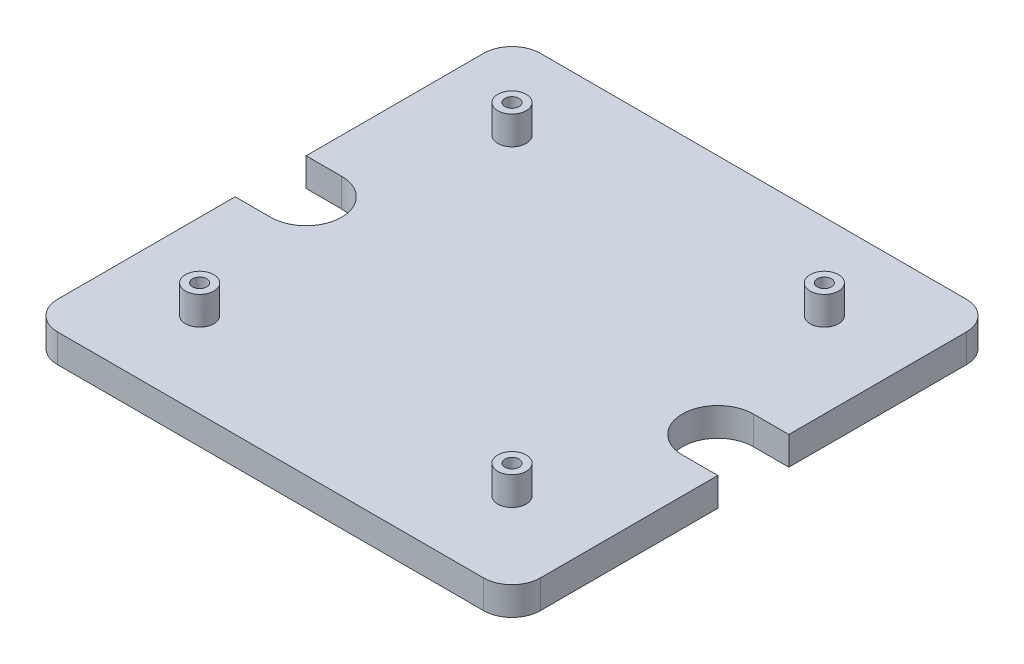
ISO-10303-21;
HEADER;
FILE_DESCRIPTION(('STEP AP214'),'2;1');
FILE_NAME('part.step','',(''),(''),'','','');
FILE_SCHEMA(('AUTOMOTIVE_DESIGN { 1 0 10303 214 1 1 1 1 }'));
ENDSEC;
DATA;
#1=APPLICATION_CONTEXT('core data for automotive mechanical design processes');
#2=APPLICATION_PROTOCOL_DEFINITION('international standard','automotive_design',2000,#1);
#3=PRODUCT_CONTEXT('',#1,'mechanical');
#4=PRODUCT('Part','Part','',(#3));
#5=PRODUCT_RELATED_PRODUCT_CATEGORY('part','',(#4));
#6=PRODUCT_DEFINITION_FORMATION('','',#4);
#7=PRODUCT_DEFINITION_CONTEXT('part definition',#1,'design');
#8=PRODUCT_DEFINITION('design','',#6,#7);
#9=PRODUCT_DEFINITION_SHAPE('','',#8);
#10=(LENGTH_UNIT() NAMED_UNIT(*) SI_UNIT(.MILLI.,.METRE.));
#11=(NAMED_UNIT(*) PLANE_ANGLE_UNIT() SI_UNIT($,.RADIAN.));
#12=(NAMED_UNIT(*) SI_UNIT($,.STERADIAN.) SOLID_ANGLE_UNIT());
#13=UNCERTAINTY_MEASURE_WITH_UNIT(LENGTH_MEASURE(1.E-05),#10,'distance_accuracy_value','');
#14=(GEOMETRIC_REPRESENTATION_CONTEXT(3) GLOBAL_UNCERTAINTY_ASSIGNED_CONTEXT((#13)) GLOBAL_UNIT_ASSIGNED_CONTEXT((#10,
#11,#12)) REPRESENTATION_CONTEXT('',''));
#15=CARTESIAN_POINT('',(0.,0.,0.));
#16=DIRECTION('',(0.,0.,1.));
#17=DIRECTION('',(1.,0.,0.));
#18=AXIS2_PLACEMENT_3D('',#15,#16,#17);
#19=CARTESIAN_POINT('',(0.,10.,0.));
#20=DIRECTION('',(1.,0.,0.));
#21=DIRECTION('',(0.,0.,-1.));
#22=AXIS2_PLACEMENT_3D('',#19,#20,#21);
#23=PLANE('',#22);
#24=DIRECTION('',(0.,1.,0.));
#25=VECTOR('',#24,1.);
#26=CARTESIAN_POINT('',(0.,0.,-72.5));
#27=LINE('',#26,#25);
#28=CARTESIAN_POINT('',(0.,0.,-72.5));
#29=VERTEX_POINT('',#28);
#30=CARTESIAN_POINT('',(0.,10.,-72.5));
#31=VERTEX_POINT('',#30);
#32=EDGE_CURVE('E198',#29,#31,#27,.T.);
#33=ORIENTED_EDGE('',*,*,#32,.F.);
#34=DIRECTION('',(0.,0.,1.));
#35=VECTOR('',#34,1.);
#36=CARTESIAN_POINT('',(0.,0.,0.));
#37=LINE('',#36,#35);
#38=CARTESIAN_POINT('',(0.,0.,-10.));
#39=VERTEX_POINT('',#38);
#40=EDGE_CURVE('E183',#29,#39,#37,.T.);
#41=ORIENTED_EDGE('',*,*,#40,.T.);
#42=DIRECTION('',(0.,-1.,0.));
#43=VECTOR('',#42,1.);
#44=CARTESIAN_POINT('',(0.,10.,-10.));
#45=LINE('',#44,#43);
#46=CARTESIAN_POINT('',(0.,10.,-10.));
#47=VERTEX_POINT('',#46);
#48=EDGE_CURVE('E55',#39,#47,#45,.F.);
#49=ORIENTED_EDGE('',*,*,#48,.T.);
#50=DIRECTION('',(0.,0.,1.));
#51=VECTOR('',#50,1.);
#52=CARTESIAN_POINT('',(0.,10.,0.));
#53=LINE('',#52,#51);
#54=EDGE_CURVE('E341',#31,#47,#53,.T.);
#55=ORIENTED_EDGE('',*,*,#54,.F.);
#56=EDGE_LOOP('',(#33,#41,#49,#55));
#57=FACE_BOUND('',#56,.T.);
#58=ADVANCED_FACE('F46',(#57),#23,.F.);
#59=CARTESIAN_POINT('',(170.,10.,0.));
#60=DIRECTION('',(-1.,0.,0.));
#61=DIRECTION('',(0.,0.,1.));
#62=AXIS2_PLACEMENT_3D('',#59,#60,#61);
#63=PLANE('',#62);
#64=DIRECTION('',(0.,1.,0.));
#65=VECTOR('',#64,1.);
#66=CARTESIAN_POINT('',(170.,0.,-97.5000000000001));
#67=LINE('',#66,#65);
#68=CARTESIAN_POINT('',(170.,0.,-97.5000000000001));
#69=VERTEX_POINT('',#68);
#70=CARTESIAN_POINT('',(170.,10.,-97.5000000000001));
#71=VERTEX_POINT('',#70);
#72=EDGE_CURVE('E232',#69,#71,#67,.T.);
#73=ORIENTED_EDGE('',*,*,#72,.F.);
#74=DIRECTION('',(0.,0.,-1.));
#75=VECTOR('',#74,1.);
#76=CARTESIAN_POINT('',(170.,0.,0.));
#77=LINE('',#76,#75);
#78=CARTESIAN_POINT('',(170.,0.,-160.));
#79=VERTEX_POINT('',#78);
#80=EDGE_CURVE('E361',#69,#79,#77,.T.);
#81=ORIENTED_EDGE('',*,*,#80,.T.);
#82=DIRECTION('',(0.,-1.,0.));
#83=VECTOR('',#82,1.);
#84=CARTESIAN_POINT('',(170.,10.,-160.));
#85=LINE('',#84,#83);
#86=CARTESIAN_POINT('',(170.,10.,-160.));
#87=VERTEX_POINT('',#86);
#88=EDGE_CURVE('E287',#79,#87,#85,.F.);
#89=ORIENTED_EDGE('',*,*,#88,.T.);
#90=DIRECTION('',(0.,0.,-1.));
#91=VECTOR('',#90,1.);
#92=CARTESIAN_POINT('',(170.,10.,0.));
#93=LINE('',#92,#91);
#94=EDGE_CURVE('E345',#71,#87,#93,.T.);
#95=ORIENTED_EDGE('',*,*,#94,.F.);
#96=EDGE_LOOP('',(#73,#81,#89,#95));
#97=FACE_BOUND('',#96,.T.);
#98=ADVANCED_FACE('F450',(#97),#63,.F.);
#99=CARTESIAN_POINT('',(0.,10.,0.));
#100=DIRECTION('',(0.,-1.,0.));
#101=DIRECTION('',(0.,0.,-1.));
#102=AXIS2_PLACEMENT_3D('',#99,#100,#101);
#103=PLANE('',#102);
#104=CARTESIAN_POINT('',(140.,10.,-140.));
#105=DIRECTION('',(0.,-1.,0.));
#106=DIRECTION('',(0.,0.,-1.));
#107=AXIS2_PLACEMENT_3D('',#104,#105,#106);
#108=CIRCLE('',#107,4.99999999999999);
#109=CARTESIAN_POINT('',(140.,10.,-145.));
#110=VERTEX_POINT('',#109);
#111=EDGE_CURVE('E283',#110,#110,#108,.F.);
#112=ORIENTED_EDGE('',*,*,#111,.F.);
#113=EDGE_LOOP('',(#112));
#114=FACE_BOUND('',#113,.T.);
#115=CARTESIAN_POINT('',(140.,10.,-30.));
#116=DIRECTION('',(0.,-1.,0.));
#117=DIRECTION('',(0.,0.,-1.));
#118=AXIS2_PLACEMENT_3D('',#115,#116,#117);
#119=CIRCLE('',#118,4.99999999999999);
#120=CARTESIAN_POINT('',(140.,10.,-35.));
#121=VERTEX_POINT('',#120);
#122=EDGE_CURVE('E288',#121,#121,#119,.F.);
#123=ORIENTED_EDGE('',*,*,#122,.F.);
#124=EDGE_LOOP('',(#123));
#125=FACE_BOUND('',#124,.T.);
#126=CARTESIAN_POINT('',(30.,10.,-30.));
#127=DIRECTION('',(0.,-1.,0.));
#128=DIRECTION('',(0.,0.,-1.));
#129=AXIS2_PLACEMENT_3D('',#126,#127,#128);
#130=CIRCLE('',#129,5.);
#131=CARTESIAN_POINT('',(30.,10.,-35.));
#132=VERTEX_POINT('',#131);
#133=EDGE_CURVE('E300',#132,#132,#130,.F.);
#134=ORIENTED_EDGE('',*,*,#133,.F.);
#135=EDGE_LOOP('',(#134));
#136=FACE_BOUND('',#135,.T.);
#137=CARTESIAN_POINT('',(29.9999999999996,10.,-140.));
#138=DIRECTION('',(0.,-1.,0.));
#139=DIRECTION('',(0.,0.,-1.));
#140=AXIS2_PLACEMENT_3D('',#137,#138,#139);
#141=CIRCLE('',#140,5.00000000000001);
#142=CARTESIAN_POINT('',(29.9999999999996,10.,-145.));
#143=VERTEX_POINT('',#142);
#144=EDGE_CURVE('E316',#143,#143,#141,.F.);
#145=ORIENTED_EDGE('',*,*,#144,.F.);
#146=EDGE_LOOP('',(#145));
#147=FACE_BOUND('',#146,.T.);
#148=DIRECTION('',(-1.,0.,0.));
#149=VECTOR('',#148,1.);
#150=CARTESIAN_POINT('',(0.,10.,-72.5));
#151=LINE('',#150,#149);
#152=CARTESIAN_POINT('',(12.5000000000001,10.,-72.5));
#153=VERTEX_POINT('',#152);
#154=EDGE_CURVE('E167',#153,#31,#151,.T.);
#155=ORIENTED_EDGE('',*,*,#154,.T.);
#156=ORIENTED_EDGE('',*,*,#54,.T.);
#157=CARTESIAN_POINT('',(10.,10.,-10.));
#158=DIRECTION('',(0.,-1.,0.));
#159=DIRECTION('',(0.,0.,-1.));
#160=AXIS2_PLACEMENT_3D('',#157,#158,#159);
#161=CIRCLE('',#160,10.);
#162=CARTESIAN_POINT('',(10.,10.,0.));
#163=VERTEX_POINT('',#162);
#164=EDGE_CURVE('E397',#47,#163,#161,.F.);
#165=ORIENTED_EDGE('',*,*,#164,.T.);
#166=DIRECTION('',(1.,0.,0.));
#167=VECTOR('',#166,1.);
#168=CARTESIAN_POINT('',(0.,10.,0.));
#169=LINE('',#168,#167);
#170=CARTESIAN_POINT('',(160.,10.,0.));
#171=VERTEX_POINT('',#170);
#172=EDGE_CURVE('E340',#163,#171,#169,.T.);
#173=ORIENTED_EDGE('',*,*,#172,.T.);
#174=CARTESIAN_POINT('',(160.,10.,-10.));
#175=DIRECTION('',(0.,-1.,0.));
#176=DIRECTION('',(0.,0.,-1.));
#177=AXIS2_PLACEMENT_3D('',#174,#175,#176);
#178=CIRCLE('',#177,10.);
#179=CARTESIAN_POINT('',(170.,10.,-10.));
#180=VERTEX_POINT('',#179);
#181=EDGE_CURVE('E406',#171,#180,#178,.F.);
#182=ORIENTED_EDGE('',*,*,#181,.T.);
#183=CARTESIAN_POINT('',(170.,10.,-72.5));
#184=VERTEX_POINT('',#183);
#185=EDGE_CURVE('E346',#180,#184,#93,.T.);
#186=ORIENTED_EDGE('',*,*,#185,.T.);
#187=DIRECTION('',(1.,0.,0.));
#188=VECTOR('',#187,1.);
#189=CARTESIAN_POINT('',(0.,10.,-72.5));
#190=LINE('',#189,#188);
#191=CARTESIAN_POINT('',(157.5,10.,-72.5));
#192=VERTEX_POINT('',#191);
#193=EDGE_CURVE('E223',#192,#184,#190,.T.);
#194=ORIENTED_EDGE('',*,*,#193,.F.);
#195=CARTESIAN_POINT('',(157.5,10.,-85.));
#196=DIRECTION('',(0.,1.,0.));
#197=DIRECTION('',(0.,0.,1.));
#198=AXIS2_PLACEMENT_3D('',#195,#196,#197);
#199=CIRCLE('',#198,12.5000000000001);
#200=CARTESIAN_POINT('',(157.5,10.,-97.5000000000001));
#201=VERTEX_POINT('',#200);
#202=EDGE_CURVE('E219',#192,#201,#199,.F.);
#203=ORIENTED_EDGE('',*,*,#202,.T.);
#204=DIRECTION('',(1.,0.,0.));
#205=VECTOR('',#204,1.);
#206=CARTESIAN_POINT('',(0.,10.,-97.5000000000001));
#207=LINE('',#206,#205);
#208=EDGE_CURVE('E212',#201,#71,#207,.T.);
#209=ORIENTED_EDGE('',*,*,#208,.T.);
#210=ORIENTED_EDGE('',*,*,#94,.T.);
#211=CARTESIAN_POINT('',(160.,10.,-160.));
#212=DIRECTION('',(0.,-1.,0.));
#213=DIRECTION('',(0.,0.,-1.));
#214=AXIS2_PLACEMENT_3D('',#211,#212,#213);
#215=CIRCLE('',#214,10.);
#216=CARTESIAN_POINT('',(160.,10.,-170.));
#217=VERTEX_POINT('',#216);
#218=EDGE_CURVE('E403',#87,#217,#215,.F.);
#219=ORIENTED_EDGE('',*,*,#218,.T.);
#220=DIRECTION('',(-1.,0.,0.));
#221=VECTOR('',#220,1.);
#222=CARTESIAN_POINT('',(0.,10.,-170.));
#223=LINE('',#222,#221);
#224=CARTESIAN_POINT('',(10.,10.,-170.));
#225=VERTEX_POINT('',#224);
#226=EDGE_CURVE('E332',#217,#225,#223,.T.);
#227=ORIENTED_EDGE('',*,*,#226,.T.);
#228=CARTESIAN_POINT('',(10.,10.,-160.));
#229=DIRECTION('',(0.,-1.,0.));
#230=DIRECTION('',(0.,0.,-1.));
#231=AXIS2_PLACEMENT_3D('',#228,#229,#230);
#232=CIRCLE('',#231,10.);
#233=CARTESIAN_POINT('',(0.,10.,-160.));
#234=VERTEX_POINT('',#233);
#235=EDGE_CURVE('E400',#225,#234,#232,.F.);
#236=ORIENTED_EDGE('',*,*,#235,.T.);
#237=CARTESIAN_POINT('',(0.,10.,-97.5000000000001));
#238=VERTEX_POINT('',#237);
#239=EDGE_CURVE('E336',#234,#238,#53,.T.);
#240=ORIENTED_EDGE('',*,*,#239,.T.);
#241=DIRECTION('',(-1.,0.,0.));
#242=VECTOR('',#241,1.);
#243=CARTESIAN_POINT('',(0.,10.,-97.5000000000001));
#244=LINE('',#243,#242);
#245=CARTESIAN_POINT('',(12.5000000000001,10.,-97.5000000000001));
#246=VERTEX_POINT('',#245);
#247=EDGE_CURVE('E185',#246,#238,#244,.T.);
#248=ORIENTED_EDGE('',*,*,#247,.F.);
#249=CARTESIAN_POINT('',(12.5000000000001,10.,-85.));
#250=DIRECTION('',(0.,1.,0.));
#251=DIRECTION('',(0.,0.,1.));
#252=AXIS2_PLACEMENT_3D('',#249,#250,#251);
#253=CIRCLE('',#252,12.5000000000001);
#254=EDGE_CURVE('E188',#153,#246,#253,.T.);
#255=ORIENTED_EDGE('',*,*,#254,.F.);
#256=EDGE_LOOP('',(#155,#156,#165,#173,#182,#186,#194,#203,#209,#210,#219,#227,#236,#240,#248,#255));
#257=FACE_BOUND('',#256,.T.);
#258=ADVANCED_FACE('F425',(#114,#125,#136,#147,#257),#103,.F.);
#259=CARTESIAN_POINT('',(0.,0.,0.));
#260=DIRECTION('',(0.,-1.,0.));
#261=DIRECTION('',(0.,0.,-1.));
#262=AXIS2_PLACEMENT_3D('',#259,#260,#261);
#263=PLANE('',#262);
#264=CARTESIAN_POINT('',(30.624999999999,0.,-35.));
#265=DIRECTION('',(0.,-1.,0.));
#266=DIRECTION('',(0.,0.,-1.));
#267=AXIS2_PLACEMENT_3D('',#264,#265,#266);
#268=CIRCLE('',#267,5.);
#269=CARTESIAN_POINT('',(30.624999999999,0.,-40.));
#270=VERTEX_POINT('',#269);
#271=EDGE_CURVE('E201',#270,#270,#268,.T.);
#272=ORIENTED_EDGE('',*,*,#271,.F.);
#273=EDGE_LOOP('',(#272));
#274=FACE_BOUND('',#273,.T.);
#275=CARTESIAN_POINT('',(139.374999999999,0.,-34.9999999999992));
#276=DIRECTION('',(0.,-1.,0.));
#277=DIRECTION('',(0.,0.,-1.));
#278=AXIS2_PLACEMENT_3D('',#275,#276,#277);
#279=CIRCLE('',#278,5.00000000000002);
#280=CARTESIAN_POINT('',(139.374999999999,0.,-39.9999999999993));
#281=VERTEX_POINT('',#280);
#282=EDGE_CURVE('E252',#281,#281,#279,.T.);
#283=ORIENTED_EDGE('',*,*,#282,.F.);
#284=EDGE_LOOP('',(#283));
#285=FACE_BOUND('',#284,.T.);
#286=CARTESIAN_POINT('',(139.375,0.,-134.999999999999));
#287=DIRECTION('',(0.,-1.,0.));
#288=DIRECTION('',(0.,0.,-1.));
#289=AXIS2_PLACEMENT_3D('',#286,#287,#288);
#290=CIRCLE('',#289,4.99999999999999);
#291=CARTESIAN_POINT('',(139.375,0.,-139.999999999999));
#292=VERTEX_POINT('',#291);
#293=EDGE_CURVE('E244',#292,#292,#290,.T.);
#294=ORIENTED_EDGE('',*,*,#293,.F.);
#295=EDGE_LOOP('',(#294));
#296=FACE_BOUND('',#295,.T.);
#297=CARTESIAN_POINT('',(30.625,0.,-135.));
#298=DIRECTION('',(0.,-1.,0.));
#299=DIRECTION('',(0.,0.,-1.));
#300=AXIS2_PLACEMENT_3D('',#297,#298,#299);
#301=CIRCLE('',#300,5.);
#302=CARTESIAN_POINT('',(30.625,0.,-140.));
#303=VERTEX_POINT('',#302);
#304=EDGE_CURVE('E243',#303,#303,#301,.T.);
#305=ORIENTED_EDGE('',*,*,#304,.F.);
#306=EDGE_LOOP('',(#305));
#307=FACE_BOUND('',#306,.T.);
#308=ORIENTED_EDGE('',*,*,#40,.F.);
#309=DIRECTION('',(-1.,0.,0.));
#310=VECTOR('',#309,1.);
#311=CARTESIAN_POINT('',(0.,0.,-72.5));
#312=LINE('',#311,#310);
#313=CARTESIAN_POINT('',(12.5000000000001,0.,-72.5));
#314=VERTEX_POINT('',#313);
#315=EDGE_CURVE('E164',#314,#29,#312,.T.);
#316=ORIENTED_EDGE('',*,*,#315,.F.);
#317=CARTESIAN_POINT('',(12.5000000000001,0.,-85.));
#318=DIRECTION('',(0.,1.,0.));
#319=DIRECTION('',(0.,0.,1.));
#320=AXIS2_PLACEMENT_3D('',#317,#318,#319);
#321=CIRCLE('',#320,12.5000000000001);
#322=CARTESIAN_POINT('',(12.5000000000001,0.,-97.5000000000001));
#323=VERTEX_POINT('',#322);
#324=EDGE_CURVE('E175',#314,#323,#321,.T.);
#325=ORIENTED_EDGE('',*,*,#324,.T.);
#326=DIRECTION('',(-1.,0.,0.));
#327=VECTOR('',#326,1.);
#328=CARTESIAN_POINT('',(0.,0.,-97.5000000000001));
#329=LINE('',#328,#327);
#330=CARTESIAN_POINT('',(0.,0.,-97.5000000000001));
#331=VERTEX_POINT('',#330);
#332=EDGE_CURVE('E62',#323,#331,#329,.T.);
#333=ORIENTED_EDGE('',*,*,#332,.T.);
#334=CARTESIAN_POINT('',(0.,0.,-160.));
#335=VERTEX_POINT('',#334);
#336=EDGE_CURVE('E353',#335,#331,#37,.T.);
#337=ORIENTED_EDGE('',*,*,#336,.F.);
#338=CARTESIAN_POINT('',(10.,0.,-160.));
#339=DIRECTION('',(0.,-1.,0.));
#340=DIRECTION('',(0.,0.,-1.));
#341=AXIS2_PLACEMENT_3D('',#338,#339,#340);
#342=CIRCLE('',#341,10.);
#343=CARTESIAN_POINT('',(10.,0.,-170.));
#344=VERTEX_POINT('',#343);
#345=EDGE_CURVE('E380',#335,#344,#342,.T.);
#346=ORIENTED_EDGE('',*,*,#345,.T.);
#347=DIRECTION('',(-1.,0.,0.));
#348=VECTOR('',#347,1.);
#349=CARTESIAN_POINT('',(0.,0.,-170.));
#350=LINE('',#349,#348);
#351=CARTESIAN_POINT('',(160.,0.,-170.));
#352=VERTEX_POINT('',#351);
#353=EDGE_CURVE('E366',#352,#344,#350,.T.);
#354=ORIENTED_EDGE('',*,*,#353,.F.);
#355=CARTESIAN_POINT('',(160.,0.,-160.));
#356=DIRECTION('',(0.,-1.,0.));
#357=DIRECTION('',(0.,0.,-1.));
#358=AXIS2_PLACEMENT_3D('',#355,#356,#357);
#359=CIRCLE('',#358,10.);
#360=EDGE_CURVE('E383',#352,#79,#359,.T.);
#361=ORIENTED_EDGE('',*,*,#360,.T.);
#362=ORIENTED_EDGE('',*,*,#80,.F.);
#363=DIRECTION('',(1.,0.,0.));
#364=VECTOR('',#363,1.);
#365=CARTESIAN_POINT('',(0.,0.,-97.5000000000001));
#366=LINE('',#365,#364);
#367=CARTESIAN_POINT('',(157.5,0.,-97.5000000000001));
#368=VERTEX_POINT('',#367);
#369=EDGE_CURVE('E215',#368,#69,#366,.T.);
#370=ORIENTED_EDGE('',*,*,#369,.F.);
#371=CARTESIAN_POINT('',(157.5,0.,-85.));
#372=DIRECTION('',(0.,1.,0.));
#373=DIRECTION('',(0.,0.,1.));
#374=AXIS2_PLACEMENT_3D('',#371,#372,#373);
#375=CIRCLE('',#374,12.5000000000001);
#376=CARTESIAN_POINT('',(157.5,0.,-72.5));
#377=VERTEX_POINT('',#376);
#378=EDGE_CURVE('E208',#377,#368,#375,.F.);
#379=ORIENTED_EDGE('',*,*,#378,.F.);
#380=DIRECTION('',(1.,0.,0.));
#381=VECTOR('',#380,1.);
#382=CARTESIAN_POINT('',(0.,0.,-72.5));
#383=LINE('',#382,#381);
#384=CARTESIAN_POINT('',(170.,0.,-72.5));
#385=VERTEX_POINT('',#384);
#386=EDGE_CURVE('E211',#377,#385,#383,.T.);
#387=ORIENTED_EDGE('',*,*,#386,.T.);
#388=CARTESIAN_POINT('',(170.,0.,-10.));
#389=VERTEX_POINT('',#388);
#390=EDGE_CURVE('E362',#389,#385,#77,.T.);
#391=ORIENTED_EDGE('',*,*,#390,.F.);
#392=CARTESIAN_POINT('',(160.,0.,-10.));
#393=DIRECTION('',(0.,-1.,0.));
#394=DIRECTION('',(0.,0.,-1.));
#395=AXIS2_PLACEMENT_3D('',#392,#393,#394);
#396=CIRCLE('',#395,10.);
#397=CARTESIAN_POINT('',(160.,0.,0.));
#398=VERTEX_POINT('',#397);
#399=EDGE_CURVE('E387',#389,#398,#396,.T.);
#400=ORIENTED_EDGE('',*,*,#399,.T.);
#401=DIRECTION('',(1.,0.,0.));
#402=VECTOR('',#401,1.);
#403=CARTESIAN_POINT('',(0.,0.,0.));
#404=LINE('',#403,#402);
#405=CARTESIAN_POINT('',(10.,0.,0.));
#406=VERTEX_POINT('',#405);
#407=EDGE_CURVE('E357',#406,#398,#404,.T.);
#408=ORIENTED_EDGE('',*,*,#407,.F.);
#409=CARTESIAN_POINT('',(10.,0.,-10.));
#410=DIRECTION('',(0.,-1.,0.));
#411=DIRECTION('',(0.,0.,-1.));
#412=AXIS2_PLACEMENT_3D('',#409,#410,#411);
#413=CIRCLE('',#412,10.);
#414=EDGE_CURVE('E377',#406,#39,#413,.T.);
#415=ORIENTED_EDGE('',*,*,#414,.T.);
#416=EDGE_LOOP('',(#308,#316,#325,#333,#337,#346,#354,#361,#362,#370,#379,#387,#391,#400,#408,#415));
#417=FACE_BOUND('',#416,.T.);
#418=ADVANCED_FACE('F181',(#274,#285,#296,#307,#417),#263,.T.);
#419=ORIENTED_EDGE('',*,*,#336,.T.);
#420=DIRECTION('',(0.,1.,0.));
#421=VECTOR('',#420,1.);
#422=CARTESIAN_POINT('',(0.,0.,-97.5000000000001));
#423=LINE('',#422,#421);
#424=EDGE_CURVE('E202',#331,#238,#423,.T.);
#425=ORIENTED_EDGE('',*,*,#424,.T.);
#426=ORIENTED_EDGE('',*,*,#239,.F.);
#427=DIRECTION('',(0.,-1.,0.));
#428=VECTOR('',#427,1.);
#429=CARTESIAN_POINT('',(0.,10.,-160.));
#430=LINE('',#429,#428);
#431=EDGE_CURVE('E12',#234,#335,#430,.T.);
#432=ORIENTED_EDGE('',*,*,#431,.T.);
#433=EDGE_LOOP('',(#419,#425,#426,#432));
#434=FACE_BOUND('',#433,.T.);
#435=ADVANCED_FACE('F473',(#434),#23,.F.);
#436=CARTESIAN_POINT('',(0.,10.,0.));
#437=DIRECTION('',(0.,0.,-1.));
#438=DIRECTION('',(-1.,0.,0.));
#439=AXIS2_PLACEMENT_3D('',#436,#437,#438);
#440=PLANE('',#439);
#441=ORIENTED_EDGE('',*,*,#407,.T.);
#442=DIRECTION('',(0.,-1.,0.));
#443=VECTOR('',#442,1.);
#444=CARTESIAN_POINT('',(160.,10.,0.));
#445=LINE('',#444,#443);
#446=EDGE_CURVE('E394',#398,#171,#445,.F.);
#447=ORIENTED_EDGE('',*,*,#446,.T.);
#448=ORIENTED_EDGE('',*,*,#172,.F.);
#449=DIRECTION('',(0.,-1.,0.));
#450=VECTOR('',#449,1.);
#451=CARTESIAN_POINT('',(10.,10.,0.));
#452=LINE('',#451,#450);
#453=EDGE_CURVE('E390',#163,#406,#452,.T.);
#454=ORIENTED_EDGE('',*,*,#453,.T.);
#455=EDGE_LOOP('',(#441,#447,#448,#454));
#456=FACE_BOUND('',#455,.T.);
#457=ADVANCED_FACE('F428',(#456),#440,.F.);
#458=ORIENTED_EDGE('',*,*,#390,.T.);
#459=DIRECTION('',(0.,1.,0.));
#460=VECTOR('',#459,1.);
#461=CARTESIAN_POINT('',(170.,0.,-72.5));
#462=LINE('',#461,#460);
#463=EDGE_CURVE('E70',#385,#184,#462,.T.);
#464=ORIENTED_EDGE('',*,*,#463,.T.);
#465=ORIENTED_EDGE('',*,*,#185,.F.);
#466=DIRECTION('',(0.,-1.,0.));
#467=VECTOR('',#466,1.);
#468=CARTESIAN_POINT('',(170.,10.,-10.));
#469=LINE('',#468,#467);
#470=EDGE_CURVE('E373',#180,#389,#469,.T.);
#471=ORIENTED_EDGE('',*,*,#470,.T.);
#472=EDGE_LOOP('',(#458,#464,#465,#471));
#473=FACE_BOUND('',#472,.T.);
#474=ADVANCED_FACE('F437',(#473),#63,.F.);
#475=CARTESIAN_POINT('',(0.,10.,-170.));
#476=DIRECTION('',(0.,0.,1.));
#477=DIRECTION('',(1.,0.,0.));
#478=AXIS2_PLACEMENT_3D('',#475,#476,#477);
#479=PLANE('',#478);
#480=ORIENTED_EDGE('',*,*,#226,.F.);
#481=DIRECTION('',(0.,-1.,0.));
#482=VECTOR('',#481,1.);
#483=CARTESIAN_POINT('',(160.,10.,-170.));
#484=LINE('',#483,#482);
#485=EDGE_CURVE('E412',#217,#352,#484,.T.);
#486=ORIENTED_EDGE('',*,*,#485,.T.);
#487=ORIENTED_EDGE('',*,*,#353,.T.);
#488=DIRECTION('',(0.,-1.,0.));
#489=VECTOR('',#488,1.);
#490=CARTESIAN_POINT('',(10.,10.,-170.));
#491=LINE('',#490,#489);
#492=EDGE_CURVE('E409',#344,#225,#491,.F.);
#493=ORIENTED_EDGE('',*,*,#492,.T.);
#494=EDGE_LOOP('',(#480,#486,#487,#493));
#495=FACE_BOUND('',#494,.T.);
#496=ADVANCED_FACE('F465',(#495),#479,.F.);
#497=CARTESIAN_POINT('',(29.9999999999996,20.,-140.));
#498=DIRECTION('',(0.,-1.,0.));
#499=DIRECTION('',(0.,0.,-1.));
#500=AXIS2_PLACEMENT_3D('',#497,#498,#499);
#501=CYLINDRICAL_SURFACE('',#500,2.5);
#502=CARTESIAN_POINT('',(29.9999999999996,20.,-140.));
#503=DIRECTION('',(0.,1.,0.));
#504=DIRECTION('',(0.,0.,1.));
#505=AXIS2_PLACEMENT_3D('',#502,#503,#504);
#506=CIRCLE('',#505,2.5);
#507=CARTESIAN_POINT('',(29.9999999999996,20.,-137.5));
#508=VERTEX_POINT('',#507);
#509=EDGE_CURVE('E320',#508,#508,#506,.T.);
#510=ORIENTED_EDGE('',*,*,#509,.T.);
#511=EDGE_LOOP('',(#510));
#512=FACE_BOUND('',#511,.T.);
#513=CARTESIAN_POINT('',(29.9999999999996,10.,-140.));
#514=DIRECTION('',(0.,-1.,0.));
#515=DIRECTION('',(0.,0.,-1.));
#516=AXIS2_PLACEMENT_3D('',#513,#514,#515);
#517=CIRCLE('',#516,2.5);
#518=CARTESIAN_POINT('',(29.9999999999996,10.,-142.5));
#519=VERTEX_POINT('',#518);
#520=EDGE_CURVE('E328',#519,#519,#517,.F.);
#521=ORIENTED_EDGE('',*,*,#520,.F.);
#522=EDGE_LOOP('',(#521));
#523=FACE_BOUND('',#522,.T.);
#524=ADVANCED_FACE('F513',(#512,#523),#501,.F.);
#525=CARTESIAN_POINT('',(29.9999999999996,20.,-140.));
#526=DIRECTION('',(0.,-1.,0.));
#527=DIRECTION('',(0.,0.,-1.));
#528=AXIS2_PLACEMENT_3D('',#525,#526,#527);
#529=CYLINDRICAL_SURFACE('',#528,5.00000000000001);
#530=CARTESIAN_POINT('',(29.9999999999996,20.,-140.));
#531=DIRECTION('',(0.,1.,0.));
#532=DIRECTION('',(0.,0.,1.));
#533=AXIS2_PLACEMENT_3D('',#530,#531,#532);
#534=CIRCLE('',#533,5.00000000000001);
#535=CARTESIAN_POINT('',(29.9999999999996,20.,-135.));
#536=VERTEX_POINT('',#535);
#537=EDGE_CURVE('E324',#536,#536,#534,.T.);
#538=ORIENTED_EDGE('',*,*,#537,.F.);
#539=EDGE_LOOP('',(#538));
#540=FACE_BOUND('',#539,.T.);
#541=ORIENTED_EDGE('',*,*,#144,.T.);
#542=EDGE_LOOP('',(#541));
#543=FACE_BOUND('',#542,.T.);
#544=ADVANCED_FACE('F634',(#540,#543),#529,.T.);
#545=CARTESIAN_POINT('',(0.,20.,0.));
#546=DIRECTION('',(0.,1.,0.));
#547=DIRECTION('',(0.,0.,1.));
#548=AXIS2_PLACEMENT_3D('',#545,#546,#547);
#549=PLANE('',#548);
#550=ORIENTED_EDGE('',*,*,#509,.F.);
#551=EDGE_LOOP('',(#550));
#552=FACE_BOUND('',#551,.T.);
#553=ORIENTED_EDGE('',*,*,#537,.T.);
#554=EDGE_LOOP('',(#553));
#555=FACE_BOUND('',#554,.T.);
#556=ADVANCED_FACE('F631',(#552,#555),#549,.T.);
#557=ORIENTED_EDGE('',*,*,#520,.T.);
#558=EDGE_LOOP('',(#557));
#559=FACE_BOUND('',#558,.T.);
#560=ADVANCED_FACE('F507',(#559),#103,.F.);
#561=CARTESIAN_POINT('',(30.,20.,-30.));
#562=DIRECTION('',(0.,-1.,0.));
#563=DIRECTION('',(0.,0.,-1.));
#564=AXIS2_PLACEMENT_3D('',#561,#562,#563);
#565=CYLINDRICAL_SURFACE('',#564,2.5);
#566=CARTESIAN_POINT('',(30.,20.,-30.));
#567=DIRECTION('',(0.,1.,0.));
#568=DIRECTION('',(0.,0.,1.));
#569=AXIS2_PLACEMENT_3D('',#566,#567,#568);
#570=CIRCLE('',#569,2.5);
#571=CARTESIAN_POINT('',(30.,20.,-27.5));
#572=VERTEX_POINT('',#571);
#573=EDGE_CURVE('E308',#572,#572,#570,.T.);
#574=ORIENTED_EDGE('',*,*,#573,.T.);
#575=EDGE_LOOP('',(#574));
#576=FACE_BOUND('',#575,.T.);
#577=CARTESIAN_POINT('',(30.,10.,-30.));
#578=DIRECTION('',(0.,-1.,0.));
#579=DIRECTION('',(0.,0.,-1.));
#580=AXIS2_PLACEMENT_3D('',#577,#578,#579);
#581=CIRCLE('',#580,2.5);
#582=CARTESIAN_POINT('',(30.,10.,-32.5));
#583=VERTEX_POINT('',#582);
#584=EDGE_CURVE('E312',#583,#583,#581,.F.);
#585=ORIENTED_EDGE('',*,*,#584,.F.);
#586=EDGE_LOOP('',(#585));
#587=FACE_BOUND('',#586,.T.);
#588=ADVANCED_FACE('F619',(#576,#587),#565,.F.);
#589=CARTESIAN_POINT('',(30.,20.,-30.));
#590=DIRECTION('',(0.,-1.,0.));
#591=DIRECTION('',(0.,0.,-1.));
#592=AXIS2_PLACEMENT_3D('',#589,#590,#591);
#593=CYLINDRICAL_SURFACE('',#592,5.);
#594=CARTESIAN_POINT('',(30.,20.,-30.));
#595=DIRECTION('',(0.,1.,0.));
#596=DIRECTION('',(0.,0.,1.));
#597=AXIS2_PLACEMENT_3D('',#594,#595,#596);
#598=CIRCLE('',#597,5.);
#599=CARTESIAN_POINT('',(30.,20.,-25.));
#600=VERTEX_POINT('',#599);
#601=EDGE_CURVE('E304',#600,#600,#598,.T.);
#602=ORIENTED_EDGE('',*,*,#601,.F.);
#603=EDGE_LOOP('',(#602));
#604=FACE_BOUND('',#603,.T.);
#605=ORIENTED_EDGE('',*,*,#133,.T.);
#606=EDGE_LOOP('',(#605));
#607=FACE_BOUND('',#606,.T.);
#608=ADVANCED_FACE('F622',(#604,#607),#593,.T.);
#609=CARTESIAN_POINT('',(0.,20.,0.));
#610=DIRECTION('',(0.,1.,0.));
#611=DIRECTION('',(0.,0.,1.));
#612=AXIS2_PLACEMENT_3D('',#609,#610,#611);
#613=PLANE('',#612);
#614=ORIENTED_EDGE('',*,*,#573,.F.);
#615=EDGE_LOOP('',(#614));
#616=FACE_BOUND('',#615,.T.);
#617=ORIENTED_EDGE('',*,*,#601,.T.);
#618=EDGE_LOOP('',(#617));
#619=FACE_BOUND('',#618,.T.);
#620=ADVANCED_FACE('F626',(#616,#619),#613,.T.);
#621=ORIENTED_EDGE('',*,*,#584,.T.);
#622=EDGE_LOOP('',(#621));
#623=FACE_BOUND('',#622,.T.);
#624=ADVANCED_FACE('F610',(#623),#103,.F.);
#625=CARTESIAN_POINT('',(140.,20.,-30.));
#626=DIRECTION('',(0.,-1.,0.));
#627=DIRECTION('',(0.,0.,-1.));
#628=AXIS2_PLACEMENT_3D('',#625,#626,#627);
#629=CYLINDRICAL_SURFACE('',#628,2.49999999999999);
#630=CARTESIAN_POINT('',(140.,20.,-30.));
#631=DIRECTION('',(0.,1.,0.));
#632=DIRECTION('',(0.,0.,1.));
#633=AXIS2_PLACEMENT_3D('',#630,#631,#632);
#634=CIRCLE('',#633,2.49999999999999);
#635=CARTESIAN_POINT('',(140.,20.,-27.5));
#636=VERTEX_POINT('',#635);
#637=EDGE_CURVE('E292',#636,#636,#634,.T.);
#638=ORIENTED_EDGE('',*,*,#637,.T.);
#639=EDGE_LOOP('',(#638));
#640=FACE_BOUND('',#639,.T.);
#641=CARTESIAN_POINT('',(140.,10.,-30.));
#642=DIRECTION('',(0.,-1.,0.));
#643=DIRECTION('',(0.,0.,-1.));
#644=AXIS2_PLACEMENT_3D('',#641,#642,#643);
#645=CIRCLE('',#644,2.49999999999999);
#646=CARTESIAN_POINT('',(140.,10.,-32.5));
#647=VERTEX_POINT('',#646);
#648=EDGE_CURVE('E296',#647,#647,#645,.F.);
#649=ORIENTED_EDGE('',*,*,#648,.F.);
#650=EDGE_LOOP('',(#649));
#651=FACE_BOUND('',#650,.T.);
#652=ADVANCED_FACE('F606',(#640,#651),#629,.F.);
#653=CARTESIAN_POINT('',(140.,20.,-30.));
#654=DIRECTION('',(0.,-1.,0.));
#655=DIRECTION('',(0.,0.,-1.));
#656=AXIS2_PLACEMENT_3D('',#653,#654,#655);
#657=CYLINDRICAL_SURFACE('',#656,4.99999999999999);
#658=CARTESIAN_POINT('',(140.,20.,-30.));
#659=DIRECTION('',(0.,1.,0.));
#660=DIRECTION('',(0.,0.,1.));
#661=AXIS2_PLACEMENT_3D('',#658,#659,#660);
#662=CIRCLE('',#661,4.99999999999999);
#663=CARTESIAN_POINT('',(140.,20.,-25.));
#664=VERTEX_POINT('',#663);
#665=EDGE_CURVE('E282',#664,#664,#662,.T.);
#666=ORIENTED_EDGE('',*,*,#665,.F.);
#667=EDGE_LOOP('',(#666));
#668=FACE_BOUND('',#667,.T.);
#669=ORIENTED_EDGE('',*,*,#122,.T.);
#670=EDGE_LOOP('',(#669));
#671=FACE_BOUND('',#670,.T.);
#672=ADVANCED_FACE('F609',(#668,#671),#657,.T.);
#673=CARTESIAN_POINT('',(0.,20.,0.));
#674=DIRECTION('',(0.,1.,0.));
#675=DIRECTION('',(0.,0.,1.));
#676=AXIS2_PLACEMENT_3D('',#673,#674,#675);
#677=PLANE('',#676);
#678=ORIENTED_EDGE('',*,*,#637,.F.);
#679=EDGE_LOOP('',(#678));
#680=FACE_BOUND('',#679,.T.);
#681=ORIENTED_EDGE('',*,*,#665,.T.);
#682=EDGE_LOOP('',(#681));
#683=FACE_BOUND('',#682,.T.);
#684=ADVANCED_FACE('F614',(#680,#683),#677,.T.);
#685=ORIENTED_EDGE('',*,*,#648,.T.);
#686=EDGE_LOOP('',(#685));
#687=FACE_BOUND('',#686,.T.);
#688=ADVANCED_FACE('F597',(#687),#103,.F.);
#689=CARTESIAN_POINT('',(140.,20.,-140.));
#690=DIRECTION('',(0.,-1.,0.));
#691=DIRECTION('',(0.,0.,-1.));
#692=AXIS2_PLACEMENT_3D('',#689,#690,#691);
#693=CYLINDRICAL_SURFACE('',#692,4.99999999999999);
#694=CARTESIAN_POINT('',(140.,20.,-140.));
#695=DIRECTION('',(0.,1.,0.));
#696=DIRECTION('',(0.,0.,1.));
#697=AXIS2_PLACEMENT_3D('',#694,#695,#696);
#698=CIRCLE('',#697,4.99999999999999);
#699=CARTESIAN_POINT('',(140.,20.,-135.));
#700=VERTEX_POINT('',#699);
#701=EDGE_CURVE('E267',#700,#700,#698,.T.);
#702=ORIENTED_EDGE('',*,*,#701,.F.);
#703=EDGE_LOOP('',(#702));
#704=FACE_BOUND('',#703,.T.);
#705=ORIENTED_EDGE('',*,*,#111,.T.);
#706=EDGE_LOOP('',(#705));
#707=FACE_BOUND('',#706,.T.);
#708=ADVANCED_FACE('F593',(#704,#707),#693,.T.);
#709=CARTESIAN_POINT('',(140.,20.,-140.));
#710=DIRECTION('',(0.,-1.,0.));
#711=DIRECTION('',(0.,0.,-1.));
#712=AXIS2_PLACEMENT_3D('',#709,#710,#711);
#713=CYLINDRICAL_SURFACE('',#712,2.5);
#714=CARTESIAN_POINT('',(140.,20.,-140.));
#715=DIRECTION('',(0.,1.,0.));
#716=DIRECTION('',(0.,0.,1.));
#717=AXIS2_PLACEMENT_3D('',#714,#715,#716);
#718=CIRCLE('',#717,2.5);
#719=CARTESIAN_POINT('',(140.,20.,-137.5));
#720=VERTEX_POINT('',#719);
#721=EDGE_CURVE('E274',#720,#720,#718,.T.);
#722=ORIENTED_EDGE('',*,*,#721,.T.);
#723=EDGE_LOOP('',(#722));
#724=FACE_BOUND('',#723,.T.);
#725=CARTESIAN_POINT('',(140.,10.,-140.));
#726=DIRECTION('',(0.,-1.,0.));
#727=DIRECTION('',(0.,0.,-1.));
#728=AXIS2_PLACEMENT_3D('',#725,#726,#727);
#729=CIRCLE('',#728,2.5);
#730=CARTESIAN_POINT('',(140.,10.,-142.5));
#731=VERTEX_POINT('',#730);
#732=EDGE_CURVE('E278',#731,#731,#729,.F.);
#733=ORIENTED_EDGE('',*,*,#732,.F.);
#734=EDGE_LOOP('',(#733));
#735=FACE_BOUND('',#734,.T.);
#736=ADVANCED_FACE('F596',(#724,#735),#713,.F.);
#737=CARTESIAN_POINT('',(0.,20.,0.));
#738=DIRECTION('',(0.,1.,0.));
#739=DIRECTION('',(0.,0.,1.));
#740=AXIS2_PLACEMENT_3D('',#737,#738,#739);
#741=PLANE('',#740);
#742=ORIENTED_EDGE('',*,*,#701,.T.);
#743=EDGE_LOOP('',(#742));
#744=FACE_BOUND('',#743,.T.);
#745=ORIENTED_EDGE('',*,*,#721,.F.);
#746=EDGE_LOOP('',(#745));
#747=FACE_BOUND('',#746,.T.);
#748=ADVANCED_FACE('F599',(#744,#747),#741,.T.);
#749=ORIENTED_EDGE('',*,*,#732,.T.);
#750=EDGE_LOOP('',(#749));
#751=FACE_BOUND('',#750,.T.);
#752=ADVANCED_FACE('F506',(#751),#103,.F.);
#753=CARTESIAN_POINT('',(160.,10.,-10.));
#754=DIRECTION('',(0.,-1.,0.));
#755=DIRECTION('',(0.,0.,-1.));
#756=AXIS2_PLACEMENT_3D('',#753,#754,#755);
#757=CYLINDRICAL_SURFACE('',#756,10.);
#758=ORIENTED_EDGE('',*,*,#181,.F.);
#759=ORIENTED_EDGE('',*,*,#446,.F.);
#760=ORIENTED_EDGE('',*,*,#399,.F.);
#761=ORIENTED_EDGE('',*,*,#470,.F.);
#762=EDGE_LOOP('',(#758,#759,#760,#761));
#763=FACE_BOUND('',#762,.T.);
#764=ADVANCED_FACE('F432',(#763),#757,.T.);
#765=CARTESIAN_POINT('',(160.,10.,-160.));
#766=DIRECTION('',(0.,-1.,0.));
#767=DIRECTION('',(0.,0.,-1.));
#768=AXIS2_PLACEMENT_3D('',#765,#766,#767);
#769=CYLINDRICAL_SURFACE('',#768,10.);
#770=ORIENTED_EDGE('',*,*,#218,.F.);
#771=ORIENTED_EDGE('',*,*,#88,.F.);
#772=ORIENTED_EDGE('',*,*,#360,.F.);
#773=ORIENTED_EDGE('',*,*,#485,.F.);
#774=EDGE_LOOP('',(#770,#771,#772,#773));
#775=FACE_BOUND('',#774,.T.);
#776=ADVANCED_FACE('F461',(#775),#769,.T.);
#777=CARTESIAN_POINT('',(10.,10.,-160.));
#778=DIRECTION('',(0.,-1.,0.));
#779=DIRECTION('',(0.,0.,-1.));
#780=AXIS2_PLACEMENT_3D('',#777,#778,#779);
#781=CYLINDRICAL_SURFACE('',#780,10.);
#782=ORIENTED_EDGE('',*,*,#235,.F.);
#783=ORIENTED_EDGE('',*,*,#492,.F.);
#784=ORIENTED_EDGE('',*,*,#345,.F.);
#785=ORIENTED_EDGE('',*,*,#431,.F.);
#786=EDGE_LOOP('',(#782,#783,#784,#785));
#787=FACE_BOUND('',#786,.T.);
#788=ADVANCED_FACE('F468',(#787),#781,.T.);
#789=CARTESIAN_POINT('',(10.,10.,-10.));
#790=DIRECTION('',(0.,-1.,0.));
#791=DIRECTION('',(0.,0.,-1.));
#792=AXIS2_PLACEMENT_3D('',#789,#790,#791);
#793=CYLINDRICAL_SURFACE('',#792,10.);
#794=ORIENTED_EDGE('',*,*,#164,.F.);
#795=ORIENTED_EDGE('',*,*,#48,.F.);
#796=ORIENTED_EDGE('',*,*,#414,.F.);
#797=ORIENTED_EDGE('',*,*,#453,.F.);
#798=EDGE_LOOP('',(#794,#795,#796,#797));
#799=FACE_BOUND('',#798,.T.);
#800=ADVANCED_FACE('F48',(#799),#793,.T.);
#801=CARTESIAN_POINT('',(30.625,6.5,-135.));
#802=DIRECTION('',(0.,-1.,0.));
#803=DIRECTION('',(0.,0.,-1.));
#804=AXIS2_PLACEMENT_3D('',#801,#802,#803);
#805=CYLINDRICAL_SURFACE('',#804,5.);
#806=CARTESIAN_POINT('',(30.625,6.5,-135.));
#807=DIRECTION('',(0.,-1.,0.));
#808=DIRECTION('',(0.,0.,-1.));
#809=AXIS2_PLACEMENT_3D('',#806,#807,#808);
#810=CIRCLE('',#809,5.);
#811=CARTESIAN_POINT('',(30.625,6.5,-140.));
#812=VERTEX_POINT('',#811);
#813=EDGE_CURVE('E263',#812,#812,#810,.T.);
#814=ORIENTED_EDGE('',*,*,#813,.F.);
#815=EDGE_LOOP('',(#814));
#816=FACE_BOUND('',#815,.T.);
#817=ORIENTED_EDGE('',*,*,#304,.T.);
#818=EDGE_LOOP('',(#817));
#819=FACE_BOUND('',#818,.T.);
#820=ADVANCED_FACE('F588',(#816,#819),#805,.F.);
#821=CARTESIAN_POINT('',(30.625,6.5,-135.));
#822=DIRECTION('',(0.,-1.,0.));
#823=DIRECTION('',(0.,0.,-1.));
#824=AXIS2_PLACEMENT_3D('',#821,#822,#823);
#825=PLANE('',#824);
#826=ORIENTED_EDGE('',*,*,#813,.T.);
#827=EDGE_LOOP('',(#826));
#828=FACE_BOUND('',#827,.T.);
#829=ADVANCED_FACE('F570',(#828),#825,.T.);
#830=CARTESIAN_POINT('',(139.375,6.5,-134.999999999999));
#831=DIRECTION('',(0.,-1.,0.));
#832=DIRECTION('',(0.,0.,-1.));
#833=AXIS2_PLACEMENT_3D('',#830,#831,#832);
#834=CYLINDRICAL_SURFACE('',#833,4.99999999999999);
#835=CARTESIAN_POINT('',(139.375,6.5,-134.999999999999));
#836=DIRECTION('',(0.,-1.,0.));
#837=DIRECTION('',(0.,0.,-1.));
#838=AXIS2_PLACEMENT_3D('',#835,#836,#837);
#839=CIRCLE('',#838,4.99999999999999);
#840=CARTESIAN_POINT('',(139.375,6.5,-139.999999999999));
#841=VERTEX_POINT('',#840);
#842=EDGE_CURVE('E239',#841,#841,#839,.T.);
#843=ORIENTED_EDGE('',*,*,#842,.F.);
#844=EDGE_LOOP('',(#843));
#845=FACE_BOUND('',#844,.T.);
#846=ORIENTED_EDGE('',*,*,#293,.T.);
#847=EDGE_LOOP('',(#846));
#848=FACE_BOUND('',#847,.T.);
#849=ADVANCED_FACE('F566',(#845,#848),#834,.F.);
#850=CARTESIAN_POINT('',(139.375,6.5,-134.999999999999));
#851=DIRECTION('',(0.,-1.,0.));
#852=DIRECTION('',(0.,0.,-1.));
#853=AXIS2_PLACEMENT_3D('',#850,#851,#852);
#854=PLANE('',#853);
#855=ORIENTED_EDGE('',*,*,#842,.T.);
#856=EDGE_LOOP('',(#855));
#857=FACE_BOUND('',#856,.T.);
#858=ADVANCED_FACE('F562',(#857),#854,.T.);
#859=CARTESIAN_POINT('',(139.374999999999,6.5,-34.9999999999992));
#860=DIRECTION('',(0.,-1.,0.));
#861=DIRECTION('',(0.,0.,-1.));
#862=AXIS2_PLACEMENT_3D('',#859,#860,#861);
#863=CYLINDRICAL_SURFACE('',#862,5.00000000000002);
#864=CARTESIAN_POINT('',(139.374999999999,6.5,-34.9999999999992));
#865=DIRECTION('',(0.,-1.,0.));
#866=DIRECTION('',(0.,0.,-1.));
#867=AXIS2_PLACEMENT_3D('',#864,#865,#866);
#868=CIRCLE('',#867,5.00000000000002);
#869=CARTESIAN_POINT('',(139.374999999999,6.5,-39.9999999999993));
#870=VERTEX_POINT('',#869);
#871=EDGE_CURVE('E248',#870,#870,#868,.T.);
#872=ORIENTED_EDGE('',*,*,#871,.F.);
#873=EDGE_LOOP('',(#872));
#874=FACE_BOUND('',#873,.T.);
#875=ORIENTED_EDGE('',*,*,#282,.T.);
#876=EDGE_LOOP('',(#875));
#877=FACE_BOUND('',#876,.T.);
#878=ADVANCED_FACE('F565',(#874,#877),#863,.F.);
#879=CARTESIAN_POINT('',(139.374999999999,6.5,-34.9999999999992));
#880=DIRECTION('',(0.,-1.,0.));
#881=DIRECTION('',(0.,0.,-1.));
#882=AXIS2_PLACEMENT_3D('',#879,#880,#881);
#883=PLANE('',#882);
#884=ORIENTED_EDGE('',*,*,#871,.T.);
#885=EDGE_LOOP('',(#884));
#886=FACE_BOUND('',#885,.T.);
#887=ADVANCED_FACE('F572',(#886),#883,.T.);
#888=CARTESIAN_POINT('',(30.624999999999,6.5,-35.));
#889=DIRECTION('',(0.,-1.,0.));
#890=DIRECTION('',(0.,0.,-1.));
#891=AXIS2_PLACEMENT_3D('',#888,#889,#890);
#892=CYLINDRICAL_SURFACE('',#891,5.);
#893=CARTESIAN_POINT('',(30.624999999999,6.5,-35.));
#894=DIRECTION('',(0.,-1.,0.));
#895=DIRECTION('',(0.,0.,-1.));
#896=AXIS2_PLACEMENT_3D('',#893,#894,#895);
#897=CIRCLE('',#896,5.);
#898=CARTESIAN_POINT('',(30.624999999999,6.5,-40.));
#899=VERTEX_POINT('',#898);
#900=EDGE_CURVE('E256',#899,#899,#897,.T.);
#901=ORIENTED_EDGE('',*,*,#900,.F.);
#902=EDGE_LOOP('',(#901));
#903=FACE_BOUND('',#902,.T.);
#904=ORIENTED_EDGE('',*,*,#271,.T.);
#905=EDGE_LOOP('',(#904));
#906=FACE_BOUND('',#905,.T.);
#907=ADVANCED_FACE('F575',(#903,#906),#892,.F.);
#908=CARTESIAN_POINT('',(30.624999999999,6.5,-35.));
#909=DIRECTION('',(0.,-1.,0.));
#910=DIRECTION('',(0.,0.,-1.));
#911=AXIS2_PLACEMENT_3D('',#908,#909,#910);
#912=PLANE('',#911);
#913=ORIENTED_EDGE('',*,*,#900,.T.);
#914=EDGE_LOOP('',(#913));
#915=FACE_BOUND('',#914,.T.);
#916=ADVANCED_FACE('F524',(#915),#912,.T.);
#917=CARTESIAN_POINT('',(157.5,0.,-85.));
#918=DIRECTION('',(0.,1.,0.));
#919=DIRECTION('',(0.,0.,1.));
#920=AXIS2_PLACEMENT_3D('',#917,#918,#919);
#921=CYLINDRICAL_SURFACE('',#920,12.5000000000001);
#922=ORIENTED_EDGE('',*,*,#202,.F.);
#923=DIRECTION('',(0.,1.,0.));
#924=VECTOR('',#923,1.);
#925=CARTESIAN_POINT('',(157.5,0.,-72.5));
#926=LINE('',#925,#924);
#927=EDGE_CURVE('E218',#377,#192,#926,.T.);
#928=ORIENTED_EDGE('',*,*,#927,.F.);
#929=ORIENTED_EDGE('',*,*,#378,.T.);
#930=DIRECTION('',(0.,1.,0.));
#931=VECTOR('',#930,1.);
#932=CARTESIAN_POINT('',(157.5,0.,-97.5000000000001));
#933=LINE('',#932,#931);
#934=EDGE_CURVE('E195',#368,#201,#933,.T.);
#935=ORIENTED_EDGE('',*,*,#934,.T.);
#936=EDGE_LOOP('',(#922,#928,#929,#935));
#937=FACE_BOUND('',#936,.T.);
#938=ADVANCED_FACE('F444',(#937),#921,.F.);
#939=CARTESIAN_POINT('',(0.,0.,-97.5000000000001));
#940=DIRECTION('',(0.,0.,1.));
#941=DIRECTION('',(1.,0.,0.));
#942=AXIS2_PLACEMENT_3D('',#939,#940,#941);
#943=PLANE('',#942);
#944=ORIENTED_EDGE('',*,*,#208,.F.);
#945=ORIENTED_EDGE('',*,*,#934,.F.);
#946=ORIENTED_EDGE('',*,*,#369,.T.);
#947=ORIENTED_EDGE('',*,*,#72,.T.);
#948=EDGE_LOOP('',(#944,#945,#946,#947));
#949=FACE_BOUND('',#948,.T.);
#950=ADVANCED_FACE('F523',(#949),#943,.T.);
#951=CARTESIAN_POINT('',(0.,0.,-72.5));
#952=DIRECTION('',(0.,0.,1.));
#953=DIRECTION('',(1.,0.,0.));
#954=AXIS2_PLACEMENT_3D('',#951,#952,#953);
#955=PLANE('',#954);
#956=ORIENTED_EDGE('',*,*,#193,.T.);
#957=ORIENTED_EDGE('',*,*,#463,.F.);
#958=ORIENTED_EDGE('',*,*,#386,.F.);
#959=ORIENTED_EDGE('',*,*,#927,.T.);
#960=EDGE_LOOP('',(#956,#957,#958,#959));
#961=FACE_BOUND('',#960,.T.);
#962=ADVANCED_FACE('F441',(#961),#955,.F.);
#963=CARTESIAN_POINT('',(0.,0.,-72.5));
#964=DIRECTION('',(0.,0.,-1.));
#965=DIRECTION('',(-1.,0.,0.));
#966=AXIS2_PLACEMENT_3D('',#963,#964,#965);
#967=PLANE('',#966);
#968=ORIENTED_EDGE('',*,*,#154,.F.);
#969=DIRECTION('',(0.,1.,0.));
#970=VECTOR('',#969,1.);
#971=CARTESIAN_POINT('',(12.5000000000001,0.,-72.5));
#972=LINE('',#971,#970);
#973=EDGE_CURVE('E160',#314,#153,#972,.T.);
#974=ORIENTED_EDGE('',*,*,#973,.F.);
#975=ORIENTED_EDGE('',*,*,#315,.T.);
#976=ORIENTED_EDGE('',*,*,#32,.T.);
#977=EDGE_LOOP('',(#968,#974,#975,#976));
#978=FACE_BOUND('',#977,.T.);
#979=ADVANCED_FACE('F162',(#978),#967,.T.);
#980=CARTESIAN_POINT('',(0.,0.,-97.5000000000001));
#981=DIRECTION('',(0.,0.,-1.));
#982=DIRECTION('',(-1.,0.,0.));
#983=AXIS2_PLACEMENT_3D('',#980,#981,#982);
#984=PLANE('',#983);
#985=ORIENTED_EDGE('',*,*,#247,.T.);
#986=ORIENTED_EDGE('',*,*,#424,.F.);
#987=ORIENTED_EDGE('',*,*,#332,.F.);
#988=DIRECTION('',(0.,1.,0.));
#989=VECTOR('',#988,1.);
#990=CARTESIAN_POINT('',(12.5000000000001,0.,-97.5000000000001));
#991=LINE('',#990,#989);
#992=EDGE_CURVE('E172',#323,#246,#991,.T.);
#993=ORIENTED_EDGE('',*,*,#992,.T.);
#994=EDGE_LOOP('',(#985,#986,#987,#993));
#995=FACE_BOUND('',#994,.T.);
#996=ADVANCED_FACE('F475',(#995),#984,.F.);
#997=CARTESIAN_POINT('',(12.5000000000001,0.,-85.));
#998=DIRECTION('',(0.,1.,0.));
#999=DIRECTION('',(0.,0.,1.));
#1000=AXIS2_PLACEMENT_3D('',#997,#998,#999);
#1001=CYLINDRICAL_SURFACE('',#1000,12.5000000000001);
#1002=ORIENTED_EDGE('',*,*,#254,.T.);
#1003=ORIENTED_EDGE('',*,*,#992,.F.);
#1004=ORIENTED_EDGE('',*,*,#324,.F.);
#1005=ORIENTED_EDGE('',*,*,#973,.T.);
#1006=EDGE_LOOP('',(#1002,#1003,#1004,#1005));
#1007=FACE_BOUND('',#1006,.T.);
#1008=ADVANCED_FACE('F176',(#1007),#1001,.F.);
#1009=CLOSED_SHELL('',(#58,#98,#258,#418,#435,#457,#474,#496,#524,#544,#556,#560,#588,#608,#620,
#624,#652,#672,#684,#688,#708,#736,#748,#752,#764,#776,#788,#800,#820,#829,#849,#858,#878,#887,
#907,#916,#938,#950,#962,#979,#996,#1008));
#1010=MANIFOLD_SOLID_BREP('B2',#1009);
#1011=ADVANCED_BREP_SHAPE_REPRESENTATION('',(#18,#1010),#14);
#1012=SHAPE_DEFINITION_REPRESENTATION(#9,#1011);
ENDSEC;
END-ISO-10303-21;
